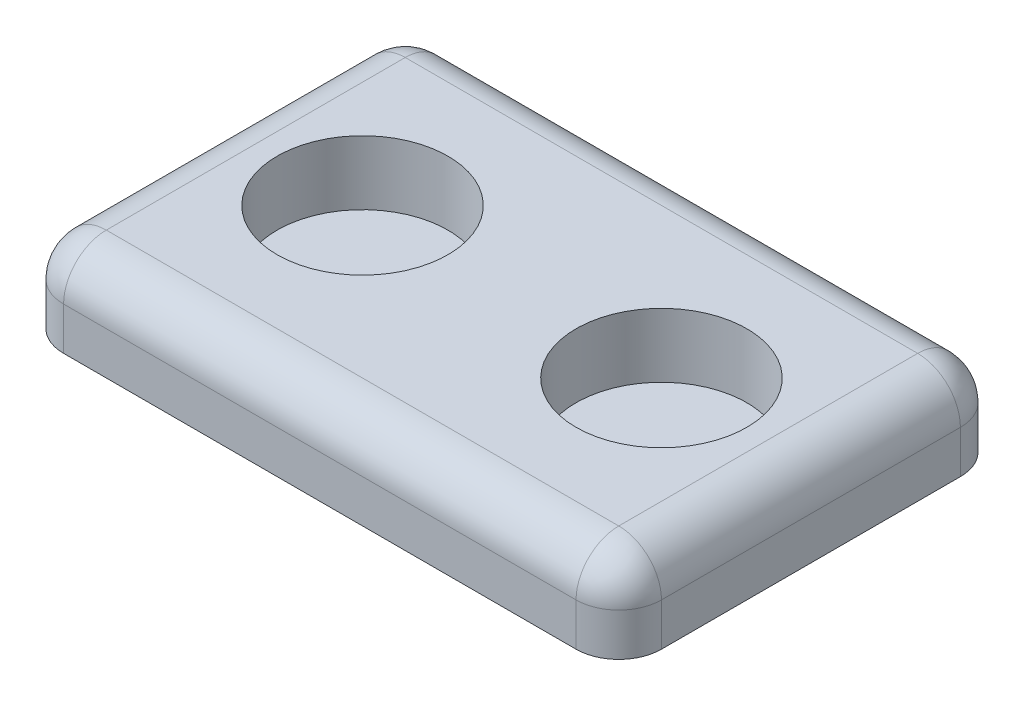
ISO-10303-21;
HEADER;
FILE_DESCRIPTION(('STEP AP214'),'2;1');
FILE_NAME('part.step','',(''),(''),'','','');
FILE_SCHEMA(('AUTOMOTIVE_DESIGN { 1 0 10303 214 1 1 1 1 }'));
ENDSEC;
DATA;
#1=APPLICATION_CONTEXT('core data for automotive mechanical design processes');
#2=APPLICATION_PROTOCOL_DEFINITION('international standard','automotive_design',2000,#1);
#3=PRODUCT_CONTEXT('',#1,'mechanical');
#4=PRODUCT('Part','Part','',(#3));
#5=PRODUCT_RELATED_PRODUCT_CATEGORY('part','',(#4));
#6=PRODUCT_DEFINITION_FORMATION('','',#4);
#7=PRODUCT_DEFINITION_CONTEXT('part definition',#1,'design');
#8=PRODUCT_DEFINITION('design','',#6,#7);
#9=PRODUCT_DEFINITION_SHAPE('','',#8);
#10=(LENGTH_UNIT() NAMED_UNIT(*) SI_UNIT(.MILLI.,.METRE.));
#11=(NAMED_UNIT(*) PLANE_ANGLE_UNIT() SI_UNIT($,.RADIAN.));
#12=(NAMED_UNIT(*) SI_UNIT($,.STERADIAN.) SOLID_ANGLE_UNIT());
#13=UNCERTAINTY_MEASURE_WITH_UNIT(LENGTH_MEASURE(1.E-05),#10,'distance_accuracy_value','');
#14=(GEOMETRIC_REPRESENTATION_CONTEXT(3) GLOBAL_UNCERTAINTY_ASSIGNED_CONTEXT((#13)) GLOBAL_UNIT_ASSIGNED_CONTEXT((#10,
#11,#12)) REPRESENTATION_CONTEXT('',''));
#15=CARTESIAN_POINT('',(0.,0.,0.));
#16=DIRECTION('',(0.,0.,1.));
#17=DIRECTION('',(1.,0.,0.));
#18=AXIS2_PLACEMENT_3D('',#15,#16,#17);
#19=CARTESIAN_POINT('',(-70.,20.,45.));
#20=DIRECTION('',(1.,0.,0.));
#21=DIRECTION('',(0.,0.,-1.));
#22=AXIS2_PLACEMENT_3D('',#19,#20,#21);
#23=PLANE('',#22);
#24=DIRECTION('',(0.,-1.,0.));
#25=VECTOR('',#24,1.);
#26=CARTESIAN_POINT('',(-70.,20.,35.));
#27=LINE('',#26,#25);
#28=CARTESIAN_POINT('',(-70.,0.,35.));
#29=VERTEX_POINT('',#28);
#30=CARTESIAN_POINT('',(-70.,10.,35.));
#31=VERTEX_POINT('',#30);
#32=EDGE_CURVE('E157',#29,#31,#27,.F.);
#33=ORIENTED_EDGE('',*,*,#32,.T.);
#34=DIRECTION('',(0.,0.,1.));
#35=VECTOR('',#34,1.);
#36=CARTESIAN_POINT('',(-70.,10.,-35.));
#37=LINE('',#36,#35);
#38=CARTESIAN_POINT('',(-70.,10.,-35.));
#39=VERTEX_POINT('',#38);
#40=EDGE_CURVE('E176',#31,#39,#37,.F.);
#41=ORIENTED_EDGE('',*,*,#40,.T.);
#42=DIRECTION('',(0.,-1.,0.));
#43=VECTOR('',#42,1.);
#44=CARTESIAN_POINT('',(-70.,20.,-35.));
#45=LINE('',#44,#43);
#46=CARTESIAN_POINT('',(-70.,0.,-35.));
#47=VERTEX_POINT('',#46);
#48=EDGE_CURVE('E160',#39,#47,#45,.T.);
#49=ORIENTED_EDGE('',*,*,#48,.T.);
#50=DIRECTION('',(0.,0.,1.));
#51=VECTOR('',#50,1.);
#52=CARTESIAN_POINT('',(-70.,0.,45.));
#53=LINE('',#52,#51);
#54=EDGE_CURVE('E141',#47,#29,#53,.T.);
#55=ORIENTED_EDGE('',*,*,#54,.T.);
#56=EDGE_LOOP('',(#33,#41,#49,#55));
#57=FACE_BOUND('',#56,.T.);
#58=ADVANCED_FACE('F35',(#57),#23,.F.);
#59=CARTESIAN_POINT('',(70.,20.,45.));
#60=DIRECTION('',(0.,0.,-1.));
#61=DIRECTION('',(-1.,0.,0.));
#62=AXIS2_PLACEMENT_3D('',#59,#60,#61);
#63=PLANE('',#62);
#64=DIRECTION('',(0.,-1.,0.));
#65=VECTOR('',#64,1.);
#66=CARTESIAN_POINT('',(60.,20.,45.));
#67=LINE('',#66,#65);
#68=CARTESIAN_POINT('',(60.,0.,45.));
#69=VERTEX_POINT('',#68);
#70=CARTESIAN_POINT('',(60.,10.,45.));
#71=VERTEX_POINT('',#70);
#72=EDGE_CURVE('E126',#69,#71,#67,.F.);
#73=ORIENTED_EDGE('',*,*,#72,.T.);
#74=DIRECTION('',(1.,0.,0.));
#75=VECTOR('',#74,1.);
#76=CARTESIAN_POINT('',(-60.,10.,45.));
#77=LINE('',#76,#75);
#78=CARTESIAN_POINT('',(-60.,10.,45.));
#79=VERTEX_POINT('',#78);
#80=EDGE_CURVE('E171',#71,#79,#77,.F.);
#81=ORIENTED_EDGE('',*,*,#80,.T.);
#82=DIRECTION('',(0.,-1.,0.));
#83=VECTOR('',#82,1.);
#84=CARTESIAN_POINT('',(-60.,20.,45.));
#85=LINE('',#84,#83);
#86=CARTESIAN_POINT('',(-60.,0.,45.));
#87=VERTEX_POINT('',#86);
#88=EDGE_CURVE('E130',#79,#87,#85,.T.);
#89=ORIENTED_EDGE('',*,*,#88,.T.);
#90=DIRECTION('',(1.,0.,0.));
#91=VECTOR('',#90,1.);
#92=CARTESIAN_POINT('',(70.,0.,45.));
#93=LINE('',#92,#91);
#94=EDGE_CURVE('E137',#87,#69,#93,.T.);
#95=ORIENTED_EDGE('',*,*,#94,.T.);
#96=EDGE_LOOP('',(#73,#81,#89,#95));
#97=FACE_BOUND('',#96,.T.);
#98=ADVANCED_FACE('F242',(#97),#63,.F.);
#99=CARTESIAN_POINT('',(70.,20.,45.));
#100=DIRECTION('',(-1.,0.,0.));
#101=DIRECTION('',(0.,0.,1.));
#102=AXIS2_PLACEMENT_3D('',#99,#100,#101);
#103=PLANE('',#102);
#104=DIRECTION('',(0.,-1.,0.));
#105=VECTOR('',#104,1.);
#106=CARTESIAN_POINT('',(70.,20.,-35.));
#107=LINE('',#106,#105);
#108=CARTESIAN_POINT('',(70.,0.,-35.));
#109=VERTEX_POINT('',#108);
#110=CARTESIAN_POINT('',(70.,10.,-35.));
#111=VERTEX_POINT('',#110);
#112=EDGE_CURVE('E120',#109,#111,#107,.F.);
#113=ORIENTED_EDGE('',*,*,#112,.T.);
#114=DIRECTION('',(0.,0.,-1.));
#115=VECTOR('',#114,1.);
#116=CARTESIAN_POINT('',(70.,10.,35.));
#117=LINE('',#116,#115);
#118=CARTESIAN_POINT('',(70.,10.,35.));
#119=VERTEX_POINT('',#118);
#120=EDGE_CURVE('E44',#111,#119,#117,.F.);
#121=ORIENTED_EDGE('',*,*,#120,.T.);
#122=DIRECTION('',(0.,-1.,0.));
#123=VECTOR('',#122,1.);
#124=CARTESIAN_POINT('',(70.,20.,35.));
#125=LINE('',#124,#123);
#126=CARTESIAN_POINT('',(70.,0.,35.));
#127=VERTEX_POINT('',#126);
#128=EDGE_CURVE('E112',#119,#127,#125,.T.);
#129=ORIENTED_EDGE('',*,*,#128,.T.);
#130=DIRECTION('',(0.,0.,-1.));
#131=VECTOR('',#130,1.);
#132=CARTESIAN_POINT('',(70.,0.,45.));
#133=LINE('',#132,#131);
#134=EDGE_CURVE('E116',#127,#109,#133,.T.);
#135=ORIENTED_EDGE('',*,*,#134,.T.);
#136=EDGE_LOOP('',(#113,#121,#129,#135));
#137=FACE_BOUND('',#136,.T.);
#138=ADVANCED_FACE('F114',(#137),#103,.F.);
#139=CARTESIAN_POINT('',(70.,20.,-45.));
#140=DIRECTION('',(0.,0.,1.));
#141=DIRECTION('',(1.,0.,0.));
#142=AXIS2_PLACEMENT_3D('',#139,#140,#141);
#143=PLANE('',#142);
#144=DIRECTION('',(0.,-1.,0.));
#145=VECTOR('',#144,1.);
#146=CARTESIAN_POINT('',(-60.,20.,-45.));
#147=LINE('',#146,#145);
#148=CARTESIAN_POINT('',(-60.,0.,-45.));
#149=VERTEX_POINT('',#148);
#150=CARTESIAN_POINT('',(-60.,10.,-45.));
#151=VERTEX_POINT('',#150);
#152=EDGE_CURVE('E152',#149,#151,#147,.F.);
#153=ORIENTED_EDGE('',*,*,#152,.T.);
#154=DIRECTION('',(-1.,0.,0.));
#155=VECTOR('',#154,1.);
#156=CARTESIAN_POINT('',(60.,10.,-45.));
#157=LINE('',#156,#155);
#158=CARTESIAN_POINT('',(60.,10.,-45.));
#159=VERTEX_POINT('',#158);
#160=EDGE_CURVE('E180',#151,#159,#157,.F.);
#161=ORIENTED_EDGE('',*,*,#160,.T.);
#162=DIRECTION('',(0.,-1.,0.));
#163=VECTOR('',#162,1.);
#164=CARTESIAN_POINT('',(60.,20.,-45.));
#165=LINE('',#164,#163);
#166=CARTESIAN_POINT('',(60.,0.,-45.));
#167=VERTEX_POINT('',#166);
#168=EDGE_CURVE('E155',#159,#167,#165,.T.);
#169=ORIENTED_EDGE('',*,*,#168,.T.);
#170=DIRECTION('',(-1.,0.,0.));
#171=VECTOR('',#170,1.);
#172=CARTESIAN_POINT('',(70.,0.,-45.));
#173=LINE('',#172,#171);
#174=EDGE_CURVE('E136',#167,#149,#173,.T.);
#175=ORIENTED_EDGE('',*,*,#174,.T.);
#176=EDGE_LOOP('',(#153,#161,#169,#175));
#177=FACE_BOUND('',#176,.T.);
#178=ADVANCED_FACE('F419',(#177),#143,.F.);
#179=CARTESIAN_POINT('',(0.,20.,0.));
#180=DIRECTION('',(0.,1.,0.));
#181=DIRECTION('',(0.,0.,1.));
#182=AXIS2_PLACEMENT_3D('',#179,#180,#181);
#183=PLANE('',#182);
#184=DIRECTION('',(0.,0.,1.));
#185=VECTOR('',#184,1.);
#186=CARTESIAN_POINT('',(-60.,20.,35.));
#187=LINE('',#186,#185);
#188=CARTESIAN_POINT('',(-60.,20.,-35.));
#189=VERTEX_POINT('',#188);
#190=CARTESIAN_POINT('',(-60.,20.,35.));
#191=VERTEX_POINT('',#190);
#192=EDGE_CURVE('E166',#189,#191,#187,.T.);
#193=ORIENTED_EDGE('',*,*,#192,.T.);
#194=DIRECTION('',(1.,0.,0.));
#195=VECTOR('',#194,1.);
#196=CARTESIAN_POINT('',(60.,20.,35.));
#197=LINE('',#196,#195);
#198=CARTESIAN_POINT('',(60.,20.,35.));
#199=VERTEX_POINT('',#198);
#200=EDGE_CURVE('E168',#191,#199,#197,.T.);
#201=ORIENTED_EDGE('',*,*,#200,.T.);
#202=DIRECTION('',(0.,0.,-1.));
#203=VECTOR('',#202,1.);
#204=CARTESIAN_POINT('',(60.,20.,-35.));
#205=LINE('',#204,#203);
#206=CARTESIAN_POINT('',(60.,20.,-35.));
#207=VERTEX_POINT('',#206);
#208=EDGE_CURVE('E162',#199,#207,#205,.T.);
#209=ORIENTED_EDGE('',*,*,#208,.T.);
#210=DIRECTION('',(-1.,0.,0.));
#211=VECTOR('',#210,1.);
#212=CARTESIAN_POINT('',(-60.,20.,-35.));
#213=LINE('',#212,#211);
#214=EDGE_CURVE('E164',#207,#189,#213,.T.);
#215=ORIENTED_EDGE('',*,*,#214,.T.);
#216=EDGE_LOOP('',(#193,#201,#209,#215));
#217=FACE_BOUND('',#216,.T.);
#218=CARTESIAN_POINT('',(35.,20.,0.));
#219=DIRECTION('',(0.,1.,0.));
#220=DIRECTION('',(0.,0.,1.));
#221=AXIS2_PLACEMENT_3D('',#218,#219,#220);
#222=CIRCLE('',#221,20.);
#223=CARTESIAN_POINT('',(35.,20.,20.));
#224=VERTEX_POINT('',#223);
#225=EDGE_CURVE('E205',#224,#224,#222,.T.);
#226=ORIENTED_EDGE('',*,*,#225,.F.);
#227=EDGE_LOOP('',(#226));
#228=FACE_BOUND('',#227,.T.);
#229=CARTESIAN_POINT('',(-35.,20.,0.));
#230=DIRECTION('',(0.,1.,0.));
#231=DIRECTION('',(0.,0.,1.));
#232=AXIS2_PLACEMENT_3D('',#229,#230,#231);
#233=CIRCLE('',#232,20.);
#234=CARTESIAN_POINT('',(-35.,20.,20.));
#235=VERTEX_POINT('',#234);
#236=EDGE_CURVE('E216',#235,#235,#233,.T.);
#237=ORIENTED_EDGE('',*,*,#236,.F.);
#238=EDGE_LOOP('',(#237));
#239=FACE_BOUND('',#238,.T.);
#240=ADVANCED_FACE('F254',(#217,#228,#239),#183,.T.);
#241=CARTESIAN_POINT('',(0.,0.,0.));
#242=DIRECTION('',(0.,1.,0.));
#243=DIRECTION('',(0.,0.,1.));
#244=AXIS2_PLACEMENT_3D('',#241,#242,#243);
#245=PLANE('',#244);
#246=ORIENTED_EDGE('',*,*,#134,.F.);
#247=CARTESIAN_POINT('',(60.,0.,35.));
#248=DIRECTION('',(0.,1.,0.));
#249=DIRECTION('',(0.,0.,1.));
#250=AXIS2_PLACEMENT_3D('',#247,#248,#249);
#251=CIRCLE('',#250,10.);
#252=EDGE_CURVE('E123',#127,#69,#251,.F.);
#253=ORIENTED_EDGE('',*,*,#252,.T.);
#254=ORIENTED_EDGE('',*,*,#94,.F.);
#255=CARTESIAN_POINT('',(-60.,0.,35.));
#256=DIRECTION('',(0.,1.,0.));
#257=DIRECTION('',(0.,0.,1.));
#258=AXIS2_PLACEMENT_3D('',#255,#256,#257);
#259=CIRCLE('',#258,10.);
#260=EDGE_CURVE('E119',#87,#29,#259,.F.);
#261=ORIENTED_EDGE('',*,*,#260,.T.);
#262=ORIENTED_EDGE('',*,*,#54,.F.);
#263=CARTESIAN_POINT('',(-60.,0.,-35.));
#264=DIRECTION('',(0.,1.,0.));
#265=DIRECTION('',(0.,0.,1.));
#266=AXIS2_PLACEMENT_3D('',#263,#264,#265);
#267=CIRCLE('',#266,10.);
#268=EDGE_CURVE('E147',#47,#149,#267,.F.);
#269=ORIENTED_EDGE('',*,*,#268,.T.);
#270=ORIENTED_EDGE('',*,*,#174,.F.);
#271=CARTESIAN_POINT('',(60.,0.,-35.));
#272=DIRECTION('',(0.,1.,0.));
#273=DIRECTION('',(0.,0.,1.));
#274=AXIS2_PLACEMENT_3D('',#271,#272,#273);
#275=CIRCLE('',#274,10.);
#276=EDGE_CURVE('E131',#167,#109,#275,.F.);
#277=ORIENTED_EDGE('',*,*,#276,.T.);
#278=EDGE_LOOP('',(#246,#253,#254,#261,#262,#269,#270,#277));
#279=FACE_BOUND('',#278,.T.);
#280=ADVANCED_FACE('F133',(#279),#245,.F.);
#281=CARTESIAN_POINT('',(-35.,5.,0.));
#282=DIRECTION('',(0.,1.,0.));
#283=DIRECTION('',(0.,0.,1.));
#284=AXIS2_PLACEMENT_3D('',#281,#282,#283);
#285=CYLINDRICAL_SURFACE('',#284,20.);
#286=CARTESIAN_POINT('',(-35.,5.,0.));
#287=DIRECTION('',(0.,1.,0.));
#288=DIRECTION('',(0.,0.,1.));
#289=AXIS2_PLACEMENT_3D('',#286,#287,#288);
#290=CIRCLE('',#289,20.);
#291=CARTESIAN_POINT('',(-35.,5.,20.));
#292=VERTEX_POINT('',#291);
#293=EDGE_CURVE('E219',#292,#292,#290,.T.);
#294=ORIENTED_EDGE('',*,*,#293,.F.);
#295=EDGE_LOOP('',(#294));
#296=FACE_BOUND('',#295,.T.);
#297=ORIENTED_EDGE('',*,*,#236,.T.);
#298=EDGE_LOOP('',(#297));
#299=FACE_BOUND('',#298,.T.);
#300=ADVANCED_FACE('F397',(#296,#299),#285,.F.);
#301=CARTESIAN_POINT('',(-35.,5.,0.));
#302=DIRECTION('',(0.,1.,0.));
#303=DIRECTION('',(0.,0.,1.));
#304=AXIS2_PLACEMENT_3D('',#301,#302,#303);
#305=PLANE('',#304);
#306=ORIENTED_EDGE('',*,*,#293,.T.);
#307=EDGE_LOOP('',(#306));
#308=FACE_BOUND('',#307,.T.);
#309=ADVANCED_FACE('F388',(#308),#305,.T.);
#310=CARTESIAN_POINT('',(35.,5.,0.));
#311=DIRECTION('',(0.,1.,0.));
#312=DIRECTION('',(0.,0.,1.));
#313=AXIS2_PLACEMENT_3D('',#310,#311,#312);
#314=CYLINDRICAL_SURFACE('',#313,20.);
#315=CARTESIAN_POINT('',(35.,5.,0.));
#316=DIRECTION('',(0.,1.,0.));
#317=DIRECTION('',(0.,0.,1.));
#318=AXIS2_PLACEMENT_3D('',#315,#316,#317);
#319=CIRCLE('',#318,20.);
#320=CARTESIAN_POINT('',(35.,5.,20.));
#321=VERTEX_POINT('',#320);
#322=EDGE_CURVE('E211',#321,#321,#319,.T.);
#323=ORIENTED_EDGE('',*,*,#322,.F.);
#324=EDGE_LOOP('',(#323));
#325=FACE_BOUND('',#324,.T.);
#326=ORIENTED_EDGE('',*,*,#225,.T.);
#327=EDGE_LOOP('',(#326));
#328=FACE_BOUND('',#327,.T.);
#329=ADVANCED_FACE('F378',(#325,#328),#314,.F.);
#330=CARTESIAN_POINT('',(35.,5.,0.));
#331=DIRECTION('',(0.,1.,0.));
#332=DIRECTION('',(0.,0.,1.));
#333=AXIS2_PLACEMENT_3D('',#330,#331,#332);
#334=PLANE('',#333);
#335=ORIENTED_EDGE('',*,*,#322,.T.);
#336=EDGE_LOOP('',(#335));
#337=FACE_BOUND('',#336,.T.);
#338=ADVANCED_FACE('F282',(#337),#334,.T.);
#339=CARTESIAN_POINT('',(60.,20.,35.));
#340=DIRECTION('',(0.,-1.,0.));
#341=DIRECTION('',(0.,0.,-1.));
#342=AXIS2_PLACEMENT_3D('',#339,#340,#341);
#343=CYLINDRICAL_SURFACE('',#342,10.);
#344=ORIENTED_EDGE('',*,*,#128,.F.);
#345=CARTESIAN_POINT('',(60.,10.,35.));
#346=DIRECTION('',(0.,-1.,0.));
#347=DIRECTION('',(0.,0.,-1.));
#348=AXIS2_PLACEMENT_3D('',#345,#346,#347);
#349=CIRCLE('',#348,10.);
#350=EDGE_CURVE('E11',#119,#71,#349,.T.);
#351=ORIENTED_EDGE('',*,*,#350,.T.);
#352=ORIENTED_EDGE('',*,*,#72,.F.);
#353=ORIENTED_EDGE('',*,*,#252,.F.);
#354=EDGE_LOOP('',(#344,#351,#352,#353));
#355=FACE_BOUND('',#354,.T.);
#356=ADVANCED_FACE('F124',(#355),#343,.T.);
#357=CARTESIAN_POINT('',(60.,20.,-35.));
#358=DIRECTION('',(0.,-1.,0.));
#359=DIRECTION('',(0.,0.,-1.));
#360=AXIS2_PLACEMENT_3D('',#357,#358,#359);
#361=CYLINDRICAL_SURFACE('',#360,10.);
#362=ORIENTED_EDGE('',*,*,#168,.F.);
#363=CARTESIAN_POINT('',(60.,10.,-35.));
#364=DIRECTION('',(0.,-1.,0.));
#365=DIRECTION('',(0.,0.,-1.));
#366=AXIS2_PLACEMENT_3D('',#363,#364,#365);
#367=CIRCLE('',#366,10.);
#368=EDGE_CURVE('E59',#159,#111,#367,.T.);
#369=ORIENTED_EDGE('',*,*,#368,.T.);
#370=ORIENTED_EDGE('',*,*,#112,.F.);
#371=ORIENTED_EDGE('',*,*,#276,.F.);
#372=EDGE_LOOP('',(#362,#369,#370,#371));
#373=FACE_BOUND('',#372,.T.);
#374=ADVANCED_FACE('F281',(#373),#361,.T.);
#375=CARTESIAN_POINT('',(-60.,20.,-35.));
#376=DIRECTION('',(0.,-1.,0.));
#377=DIRECTION('',(0.,0.,-1.));
#378=AXIS2_PLACEMENT_3D('',#375,#376,#377);
#379=CYLINDRICAL_SURFACE('',#378,10.);
#380=ORIENTED_EDGE('',*,*,#48,.F.);
#381=CARTESIAN_POINT('',(-60.,10.,-35.));
#382=DIRECTION('',(0.,-1.,0.));
#383=DIRECTION('',(0.,0.,-1.));
#384=AXIS2_PLACEMENT_3D('',#381,#382,#383);
#385=CIRCLE('',#384,10.);
#386=EDGE_CURVE('E178',#39,#151,#385,.T.);
#387=ORIENTED_EDGE('',*,*,#386,.T.);
#388=ORIENTED_EDGE('',*,*,#152,.F.);
#389=ORIENTED_EDGE('',*,*,#268,.F.);
#390=EDGE_LOOP('',(#380,#387,#388,#389));
#391=FACE_BOUND('',#390,.T.);
#392=ADVANCED_FACE('F260',(#391),#379,.T.);
#393=CARTESIAN_POINT('',(-60.,20.,35.));
#394=DIRECTION('',(0.,-1.,0.));
#395=DIRECTION('',(0.,0.,-1.));
#396=AXIS2_PLACEMENT_3D('',#393,#394,#395);
#397=CYLINDRICAL_SURFACE('',#396,10.);
#398=ORIENTED_EDGE('',*,*,#88,.F.);
#399=CARTESIAN_POINT('',(-60.,10.,35.));
#400=DIRECTION('',(0.,-1.,0.));
#401=DIRECTION('',(0.,0.,-1.));
#402=AXIS2_PLACEMENT_3D('',#399,#400,#401);
#403=CIRCLE('',#402,10.);
#404=EDGE_CURVE('E174',#79,#31,#403,.T.);
#405=ORIENTED_EDGE('',*,*,#404,.T.);
#406=ORIENTED_EDGE('',*,*,#32,.F.);
#407=ORIENTED_EDGE('',*,*,#260,.F.);
#408=EDGE_LOOP('',(#398,#405,#406,#407));
#409=FACE_BOUND('',#408,.T.);
#410=ADVANCED_FACE('F233',(#409),#397,.T.);
#411=CARTESIAN_POINT('',(0.,10.,-35.));
#412=DIRECTION('',(1.,0.,0.));
#413=DIRECTION('',(0.,0.,-1.));
#414=AXIS2_PLACEMENT_3D('',#411,#412,#413);
#415=CYLINDRICAL_SURFACE('',#414,10.);
#416=CARTESIAN_POINT('',(60.,10.,-35.));
#417=DIRECTION('',(1.,0.,0.));
#418=DIRECTION('',(0.,0.,-1.));
#419=AXIS2_PLACEMENT_3D('',#416,#417,#418);
#420=CIRCLE('',#419,10.);
#421=EDGE_CURVE('E199',#159,#207,#420,.T.);
#422=ORIENTED_EDGE('',*,*,#421,.F.);
#423=ORIENTED_EDGE('',*,*,#160,.F.);
#424=CARTESIAN_POINT('',(-60.,10.,-35.));
#425=DIRECTION('',(-1.,0.,0.));
#426=DIRECTION('',(0.,0.,1.));
#427=AXIS2_PLACEMENT_3D('',#424,#425,#426);
#428=CIRCLE('',#427,10.);
#429=EDGE_CURVE('E39',#189,#151,#428,.T.);
#430=ORIENTED_EDGE('',*,*,#429,.F.);
#431=ORIENTED_EDGE('',*,*,#214,.F.);
#432=EDGE_LOOP('',(#422,#423,#430,#431));
#433=FACE_BOUND('',#432,.T.);
#434=ADVANCED_FACE('F37',(#433),#415,.T.);
#435=CARTESIAN_POINT('',(-60.,10.,-35.));
#436=DIRECTION('',(0.,0.,1.));
#437=DIRECTION('',(1.,0.,0.));
#438=AXIS2_PLACEMENT_3D('',#435,#436,#437);
#439=SPHERICAL_SURFACE('',#438,10.);
#440=ORIENTED_EDGE('',*,*,#429,.T.);
#441=ORIENTED_EDGE('',*,*,#386,.F.);
#442=CARTESIAN_POINT('',(-60.,10.,-35.));
#443=DIRECTION('',(0.,0.,1.));
#444=DIRECTION('',(1.,0.,0.));
#445=AXIS2_PLACEMENT_3D('',#442,#443,#444);
#446=CIRCLE('',#445,10.);
#447=EDGE_CURVE('E197',#189,#39,#446,.T.);
#448=ORIENTED_EDGE('',*,*,#447,.F.);
#449=EDGE_LOOP('',(#440,#441,#448));
#450=FACE_BOUND('',#449,.T.);
#451=ADVANCED_FACE('F262',(#450),#439,.T.);
#452=CARTESIAN_POINT('',(60.,10.,-35.));
#453=DIRECTION('',(0.,0.,1.));
#454=DIRECTION('',(1.,0.,0.));
#455=AXIS2_PLACEMENT_3D('',#452,#453,#454);
#456=SPHERICAL_SURFACE('',#455,10.);
#457=ORIENTED_EDGE('',*,*,#368,.F.);
#458=ORIENTED_EDGE('',*,*,#421,.T.);
#459=CARTESIAN_POINT('',(60.,10.,-35.));
#460=DIRECTION('',(0.,0.,1.));
#461=DIRECTION('',(1.,0.,0.));
#462=AXIS2_PLACEMENT_3D('',#459,#460,#461);
#463=CIRCLE('',#462,10.);
#464=EDGE_CURVE('E194',#111,#207,#463,.T.);
#465=ORIENTED_EDGE('',*,*,#464,.F.);
#466=EDGE_LOOP('',(#457,#458,#465));
#467=FACE_BOUND('',#466,.T.);
#468=ADVANCED_FACE('F264',(#467),#456,.T.);
#469=CARTESIAN_POINT('',(-60.,10.,0.));
#470=DIRECTION('',(0.,0.,-1.));
#471=DIRECTION('',(-1.,0.,0.));
#472=AXIS2_PLACEMENT_3D('',#469,#470,#471);
#473=CYLINDRICAL_SURFACE('',#472,10.);
#474=ORIENTED_EDGE('',*,*,#447,.T.);
#475=ORIENTED_EDGE('',*,*,#40,.F.);
#476=CARTESIAN_POINT('',(-60.,10.,35.));
#477=DIRECTION('',(0.,0.,1.));
#478=DIRECTION('',(1.,0.,0.));
#479=AXIS2_PLACEMENT_3D('',#476,#477,#478);
#480=CIRCLE('',#479,10.);
#481=EDGE_CURVE('E191',#191,#31,#480,.T.);
#482=ORIENTED_EDGE('',*,*,#481,.F.);
#483=ORIENTED_EDGE('',*,*,#192,.F.);
#484=EDGE_LOOP('',(#474,#475,#482,#483));
#485=FACE_BOUND('',#484,.T.);
#486=ADVANCED_FACE('F258',(#485),#473,.T.);
#487=CARTESIAN_POINT('',(60.,10.,0.));
#488=DIRECTION('',(0.,0.,1.));
#489=DIRECTION('',(1.,0.,0.));
#490=AXIS2_PLACEMENT_3D('',#487,#488,#489);
#491=CYLINDRICAL_SURFACE('',#490,10.);
#492=ORIENTED_EDGE('',*,*,#464,.T.);
#493=ORIENTED_EDGE('',*,*,#208,.F.);
#494=CARTESIAN_POINT('',(60.,10.,35.));
#495=DIRECTION('',(0.,0.,1.));
#496=DIRECTION('',(1.,0.,0.));
#497=AXIS2_PLACEMENT_3D('',#494,#495,#496);
#498=CIRCLE('',#497,10.);
#499=EDGE_CURVE('E188',#119,#199,#498,.T.);
#500=ORIENTED_EDGE('',*,*,#499,.F.);
#501=ORIENTED_EDGE('',*,*,#120,.F.);
#502=EDGE_LOOP('',(#492,#493,#500,#501));
#503=FACE_BOUND('',#502,.T.);
#504=ADVANCED_FACE('F251',(#503),#491,.T.);
#505=CARTESIAN_POINT('',(-60.,10.,35.));
#506=DIRECTION('',(0.,0.,1.));
#507=DIRECTION('',(1.,0.,0.));
#508=AXIS2_PLACEMENT_3D('',#505,#506,#507);
#509=SPHERICAL_SURFACE('',#508,10.);
#510=ORIENTED_EDGE('',*,*,#481,.T.);
#511=ORIENTED_EDGE('',*,*,#404,.F.);
#512=CARTESIAN_POINT('',(-60.,10.,35.));
#513=DIRECTION('',(1.,0.,0.));
#514=DIRECTION('',(0.,0.,-1.));
#515=AXIS2_PLACEMENT_3D('',#512,#513,#514);
#516=CIRCLE('',#515,10.);
#517=EDGE_CURVE('E186',#191,#79,#516,.T.);
#518=ORIENTED_EDGE('',*,*,#517,.F.);
#519=EDGE_LOOP('',(#510,#511,#518));
#520=FACE_BOUND('',#519,.T.);
#521=ADVANCED_FACE('F237',(#520),#509,.T.);
#522=CARTESIAN_POINT('',(60.,10.,35.));
#523=DIRECTION('',(0.,0.,1.));
#524=DIRECTION('',(1.,0.,0.));
#525=AXIS2_PLACEMENT_3D('',#522,#523,#524);
#526=SPHERICAL_SURFACE('',#525,10.);
#527=ORIENTED_EDGE('',*,*,#350,.F.);
#528=ORIENTED_EDGE('',*,*,#499,.T.);
#529=CARTESIAN_POINT('',(60.,10.,35.));
#530=DIRECTION('',(-1.,0.,0.));
#531=DIRECTION('',(0.,0.,1.));
#532=AXIS2_PLACEMENT_3D('',#529,#530,#531);
#533=CIRCLE('',#532,10.);
#534=EDGE_CURVE('E184',#71,#199,#533,.T.);
#535=ORIENTED_EDGE('',*,*,#534,.F.);
#536=EDGE_LOOP('',(#527,#528,#535));
#537=FACE_BOUND('',#536,.T.);
#538=ADVANCED_FACE('F248',(#537),#526,.T.);
#539=CARTESIAN_POINT('',(0.,10.,35.));
#540=DIRECTION('',(-1.,0.,0.));
#541=DIRECTION('',(0.,0.,1.));
#542=AXIS2_PLACEMENT_3D('',#539,#540,#541);
#543=CYLINDRICAL_SURFACE('',#542,10.);
#544=ORIENTED_EDGE('',*,*,#517,.T.);
#545=ORIENTED_EDGE('',*,*,#80,.F.);
#546=ORIENTED_EDGE('',*,*,#534,.T.);
#547=ORIENTED_EDGE('',*,*,#200,.F.);
#548=EDGE_LOOP('',(#544,#545,#546,#547));
#549=FACE_BOUND('',#548,.T.);
#550=ADVANCED_FACE('F245',(#549),#543,.T.);
#551=CLOSED_SHELL('',(#58,#98,#138,#178,#240,#280,#300,#309,#329,#338,#356,#374,#392,#410,#434,
#451,#468,#486,#504,#521,#538,#550));
#552=MANIFOLD_SOLID_BREP('B2',#551);
#553=ADVANCED_BREP_SHAPE_REPRESENTATION('',(#18,#552),#14);
#554=SHAPE_DEFINITION_REPRESENTATION(#9,#553);
ENDSEC;
END-ISO-10303-21;
